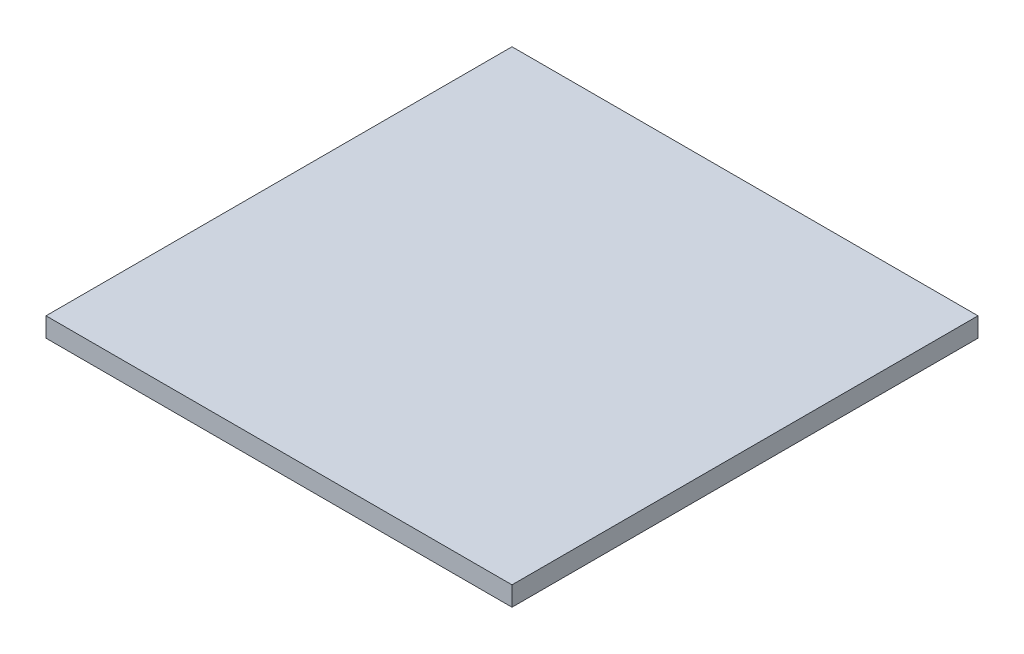
ISO-10303-21;
HEADER;
FILE_DESCRIPTION(('STEP AP214'),'2;1');
FILE_NAME('part.step','',(''),(''),'','','');
FILE_SCHEMA(('AUTOMOTIVE_DESIGN { 1 0 10303 214 1 1 1 1 }'));
ENDSEC;
DATA;
#1=APPLICATION_CONTEXT('core data for automotive mechanical design processes');
#2=APPLICATION_PROTOCOL_DEFINITION('international standard','automotive_design',2000,#1);
#3=PRODUCT_CONTEXT('',#1,'mechanical');
#4=PRODUCT('Part','Part','',(#3));
#5=PRODUCT_RELATED_PRODUCT_CATEGORY('part','',(#4));
#6=PRODUCT_DEFINITION_FORMATION('','',#4);
#7=PRODUCT_DEFINITION_CONTEXT('part definition',#1,'design');
#8=PRODUCT_DEFINITION('design','',#6,#7);
#9=PRODUCT_DEFINITION_SHAPE('','',#8);
#10=(LENGTH_UNIT() NAMED_UNIT(*) SI_UNIT(.MILLI.,.METRE.));
#11=(NAMED_UNIT(*) PLANE_ANGLE_UNIT() SI_UNIT($,.RADIAN.));
#12=(NAMED_UNIT(*) SI_UNIT($,.STERADIAN.) SOLID_ANGLE_UNIT());
#13=UNCERTAINTY_MEASURE_WITH_UNIT(LENGTH_MEASURE(1.E-05),#10,'distance_accuracy_value','');
#14=(GEOMETRIC_REPRESENTATION_CONTEXT(3) GLOBAL_UNCERTAINTY_ASSIGNED_CONTEXT((#13)) GLOBAL_UNIT_ASSIGNED_CONTEXT((#10,
#11,#12)) REPRESENTATION_CONTEXT('',''));
#15=CARTESIAN_POINT('',(0.,0.,0.));
#16=DIRECTION('',(0.,0.,1.));
#17=DIRECTION('',(1.,0.,0.));
#18=AXIS2_PLACEMENT_3D('',#15,#16,#17);
#19=CARTESIAN_POINT('',(18.,1.5,18.));
#20=DIRECTION('',(-1.,0.,0.));
#21=DIRECTION('',(0.,0.,1.));
#22=AXIS2_PLACEMENT_3D('',#19,#20,#21);
#23=PLANE('',#22);
#24=DIRECTION('',(0.,0.,-1.));
#25=VECTOR('',#24,1.);
#26=CARTESIAN_POINT('',(18.,0.,18.));
#27=LINE('',#26,#25);
#28=CARTESIAN_POINT('',(18.,0.,18.));
#29=VERTEX_POINT('',#28);
#30=CARTESIAN_POINT('',(18.,0.,-18.));
#31=VERTEX_POINT('',#30);
#32=EDGE_CURVE('E96',#29,#31,#27,.T.);
#33=ORIENTED_EDGE('',*,*,#32,.T.);
#34=DIRECTION('',(0.,-1.,0.));
#35=VECTOR('',#34,1.);
#36=CARTESIAN_POINT('',(18.,1.5,-18.));
#37=LINE('',#36,#35);
#38=CARTESIAN_POINT('',(18.,1.5,-18.));
#39=VERTEX_POINT('',#38);
#40=EDGE_CURVE('E11',#39,#31,#37,.T.);
#41=ORIENTED_EDGE('',*,*,#40,.F.);
#42=DIRECTION('',(0.,0.,-1.));
#43=VECTOR('',#42,1.);
#44=CARTESIAN_POINT('',(18.,1.5,18.));
#45=LINE('',#44,#43);
#46=CARTESIAN_POINT('',(18.,1.5,18.));
#47=VERTEX_POINT('',#46);
#48=EDGE_CURVE('E84',#47,#39,#45,.T.);
#49=ORIENTED_EDGE('',*,*,#48,.F.);
#50=DIRECTION('',(0.,-1.,0.));
#51=VECTOR('',#50,1.);
#52=CARTESIAN_POINT('',(18.,1.5,18.));
#53=LINE('',#52,#51);
#54=EDGE_CURVE('E92',#47,#29,#53,.T.);
#55=ORIENTED_EDGE('',*,*,#54,.T.);
#56=EDGE_LOOP('',(#33,#41,#49,#55));
#57=FACE_BOUND('',#56,.T.);
#58=ADVANCED_FACE('F33',(#57),#23,.F.);
#59=CARTESIAN_POINT('',(-18.,1.5,-18.));
#60=DIRECTION('',(0.,0.,1.));
#61=DIRECTION('',(1.,0.,0.));
#62=AXIS2_PLACEMENT_3D('',#59,#60,#61);
#63=PLANE('',#62);
#64=DIRECTION('',(-1.,0.,0.));
#65=VECTOR('',#64,1.);
#66=CARTESIAN_POINT('',(-18.,0.,-18.));
#67=LINE('',#66,#65);
#68=CARTESIAN_POINT('',(-18.,0.,-18.));
#69=VERTEX_POINT('',#68);
#70=EDGE_CURVE('E88',#31,#69,#67,.T.);
#71=ORIENTED_EDGE('',*,*,#70,.T.);
#72=DIRECTION('',(0.,-1.,0.));
#73=VECTOR('',#72,1.);
#74=CARTESIAN_POINT('',(-18.,1.5,-18.));
#75=LINE('',#74,#73);
#76=CARTESIAN_POINT('',(-18.,1.5,-18.));
#77=VERTEX_POINT('',#76);
#78=EDGE_CURVE('E41',#77,#69,#75,.T.);
#79=ORIENTED_EDGE('',*,*,#78,.F.);
#80=DIRECTION('',(-1.,0.,0.));
#81=VECTOR('',#80,1.);
#82=CARTESIAN_POINT('',(-18.,1.5,-18.));
#83=LINE('',#82,#81);
#84=EDGE_CURVE('E79',#39,#77,#83,.T.);
#85=ORIENTED_EDGE('',*,*,#84,.F.);
#86=ORIENTED_EDGE('',*,*,#40,.T.);
#87=EDGE_LOOP('',(#71,#79,#85,#86));
#88=FACE_BOUND('',#87,.T.);
#89=ADVANCED_FACE('F87',(#88),#63,.F.);
#90=CARTESIAN_POINT('',(-18.,1.5,18.));
#91=DIRECTION('',(1.,0.,0.));
#92=DIRECTION('',(0.,0.,-1.));
#93=AXIS2_PLACEMENT_3D('',#90,#91,#92);
#94=PLANE('',#93);
#95=DIRECTION('',(0.,0.,1.));
#96=VECTOR('',#95,1.);
#97=CARTESIAN_POINT('',(-18.,0.,18.));
#98=LINE('',#97,#96);
#99=CARTESIAN_POINT('',(-18.,0.,18.));
#100=VERTEX_POINT('',#99);
#101=EDGE_CURVE('E66',#69,#100,#98,.T.);
#102=ORIENTED_EDGE('',*,*,#101,.T.);
#103=DIRECTION('',(0.,-1.,0.));
#104=VECTOR('',#103,1.);
#105=CARTESIAN_POINT('',(-18.,1.5,18.));
#106=LINE('',#105,#104);
#107=CARTESIAN_POINT('',(-18.,1.5,18.));
#108=VERTEX_POINT('',#107);
#109=EDGE_CURVE('E89',#108,#100,#106,.T.);
#110=ORIENTED_EDGE('',*,*,#109,.F.);
#111=DIRECTION('',(0.,0.,1.));
#112=VECTOR('',#111,1.);
#113=CARTESIAN_POINT('',(-18.,1.5,18.));
#114=LINE('',#113,#112);
#115=EDGE_CURVE('E82',#77,#108,#114,.T.);
#116=ORIENTED_EDGE('',*,*,#115,.F.);
#117=ORIENTED_EDGE('',*,*,#78,.T.);
#118=EDGE_LOOP('',(#102,#110,#116,#117));
#119=FACE_BOUND('',#118,.T.);
#120=ADVANCED_FACE('F90',(#119),#94,.F.);
#121=CARTESIAN_POINT('',(-18.,1.5,18.));
#122=DIRECTION('',(0.,0.,-1.));
#123=DIRECTION('',(-1.,0.,0.));
#124=AXIS2_PLACEMENT_3D('',#121,#122,#123);
#125=PLANE('',#124);
#126=DIRECTION('',(1.,0.,0.));
#127=VECTOR('',#126,1.);
#128=CARTESIAN_POINT('',(-18.,0.,18.));
#129=LINE('',#128,#127);
#130=EDGE_CURVE('E72',#100,#29,#129,.T.);
#131=ORIENTED_EDGE('',*,*,#130,.T.);
#132=ORIENTED_EDGE('',*,*,#54,.F.);
#133=DIRECTION('',(1.,0.,0.));
#134=VECTOR('',#133,1.);
#135=CARTESIAN_POINT('',(-18.,1.5,18.));
#136=LINE('',#135,#134);
#137=EDGE_CURVE('E49',#108,#47,#136,.T.);
#138=ORIENTED_EDGE('',*,*,#137,.F.);
#139=ORIENTED_EDGE('',*,*,#109,.T.);
#140=EDGE_LOOP('',(#131,#132,#138,#139));
#141=FACE_BOUND('',#140,.T.);
#142=ADVANCED_FACE('F103',(#141),#125,.F.);
#143=CARTESIAN_POINT('',(0.,1.5,0.));
#144=DIRECTION('',(0.,-1.,0.));
#145=DIRECTION('',(0.,0.,-1.));
#146=AXIS2_PLACEMENT_3D('',#143,#144,#145);
#147=PLANE('',#146);
#148=ORIENTED_EDGE('',*,*,#48,.T.);
#149=ORIENTED_EDGE('',*,*,#84,.T.);
#150=ORIENTED_EDGE('',*,*,#115,.T.);
#151=ORIENTED_EDGE('',*,*,#137,.T.);
#152=EDGE_LOOP('',(#148,#149,#150,#151));
#153=FACE_BOUND('',#152,.T.);
#154=ADVANCED_FACE('F80',(#153),#147,.F.);
#155=CARTESIAN_POINT('',(0.,0.,0.));
#156=DIRECTION('',(0.,-1.,0.));
#157=DIRECTION('',(0.,0.,-1.));
#158=AXIS2_PLACEMENT_3D('',#155,#156,#157);
#159=PLANE('',#158);
#160=ORIENTED_EDGE('',*,*,#32,.F.);
#161=ORIENTED_EDGE('',*,*,#130,.F.);
#162=ORIENTED_EDGE('',*,*,#101,.F.);
#163=ORIENTED_EDGE('',*,*,#70,.F.);
#164=EDGE_LOOP('',(#160,#161,#162,#163));
#165=FACE_BOUND('',#164,.T.);
#166=ADVANCED_FACE('F106',(#165),#159,.T.);
#167=CLOSED_SHELL('',(#58,#89,#120,#142,#154,#166));
#168=MANIFOLD_SOLID_BREP('B2',#167);
#169=ADVANCED_BREP_SHAPE_REPRESENTATION('',(#18,#168),#14);
#170=SHAPE_DEFINITION_REPRESENTATION(#9,#169);
ENDSEC;
END-ISO-10303-21;
